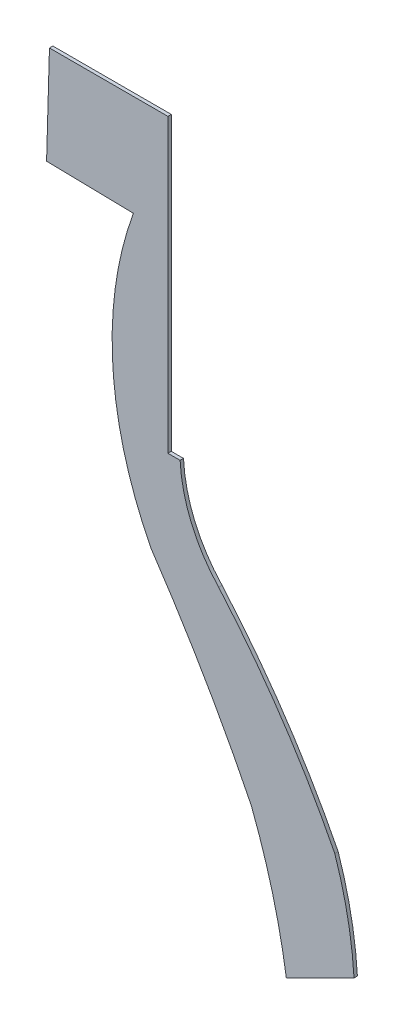
ISO-10303-21;
HEADER;
FILE_DESCRIPTION(('STEP AP214'),'2;1');
FILE_NAME('part.step','',(''),(''),'','','');
FILE_SCHEMA(('AUTOMOTIVE_DESIGN { 1 0 10303 214 1 1 1 1 }'));
ENDSEC;
DATA;
#1=APPLICATION_CONTEXT('core data for automotive mechanical design processes');
#2=APPLICATION_PROTOCOL_DEFINITION('international standard','automotive_design',2000,#1);
#3=PRODUCT_CONTEXT('',#1,'mechanical');
#4=PRODUCT('Part','Part','',(#3));
#5=PRODUCT_RELATED_PRODUCT_CATEGORY('part','',(#4));
#6=PRODUCT_DEFINITION_FORMATION('','',#4);
#7=PRODUCT_DEFINITION_CONTEXT('part definition',#1,'design');
#8=PRODUCT_DEFINITION('design','',#6,#7);
#9=PRODUCT_DEFINITION_SHAPE('','',#8);
#10=(LENGTH_UNIT() NAMED_UNIT(*) SI_UNIT(.MILLI.,.METRE.));
#11=(NAMED_UNIT(*) PLANE_ANGLE_UNIT() SI_UNIT($,.RADIAN.));
#12=(NAMED_UNIT(*) SI_UNIT($,.STERADIAN.) SOLID_ANGLE_UNIT());
#13=UNCERTAINTY_MEASURE_WITH_UNIT(LENGTH_MEASURE(1.E-05),#10,'distance_accuracy_value','');
#14=(GEOMETRIC_REPRESENTATION_CONTEXT(3) GLOBAL_UNCERTAINTY_ASSIGNED_CONTEXT((#13)) GLOBAL_UNIT_ASSIGNED_CONTEXT((#10,
#11,#12)) REPRESENTATION_CONTEXT('',''));
#15=CARTESIAN_POINT('',(0.,0.,0.));
#16=DIRECTION('',(0.,0.,1.));
#17=DIRECTION('',(1.,0.,0.));
#18=AXIS2_PLACEMENT_3D('',#15,#16,#17);
#19=CARTESIAN_POINT('',(20.883239029855,8.34188143501199,0.1));
#20=DIRECTION('',(0.,0.,-1.));
#21=DIRECTION('',(-1.,0.,0.));
#22=AXIS2_PLACEMENT_3D('',#19,#20,#21);
#23=CYLINDRICAL_SURFACE('',#22,4.2453518742841);
#24=CARTESIAN_POINT('',(20.883239029855,8.34188143501199,0.));
#25=DIRECTION('',(0.,0.,-1.));
#26=DIRECTION('',(1.,0.,0.));
#27=AXIS2_PLACEMENT_3D('',#24,#25,#26);
#28=CIRCLE('',#27,4.2453518742841);
#29=CARTESIAN_POINT('',(17.7828452557715,5.44178299149117,0.));
#30=VERTEX_POINT('',#29);
#31=CARTESIAN_POINT('',(16.6436989690737,8.11981700850885,0.));
#32=VERTEX_POINT('',#31);
#33=EDGE_CURVE('E153',#30,#32,#28,.T.);
#34=ORIENTED_EDGE('',*,*,#33,.T.);
#35=DIRECTION('',(0.,0.,-1.));
#36=VECTOR('',#35,1.);
#37=CARTESIAN_POINT('',(16.6436989690737,8.11981700850885,0.1));
#38=LINE('',#37,#36);
#39=CARTESIAN_POINT('',(16.6436989690737,8.11981700850885,0.1));
#40=VERTEX_POINT('',#39);
#41=EDGE_CURVE('E11',#40,#32,#38,.T.);
#42=ORIENTED_EDGE('',*,*,#41,.F.);
#43=CARTESIAN_POINT('',(20.883239029855,8.34188143501199,0.1));
#44=DIRECTION('',(0.,0.,-1.));
#45=DIRECTION('',(1.,0.,0.));
#46=AXIS2_PLACEMENT_3D('',#43,#44,#45);
#47=CIRCLE('',#46,4.2453518742841);
#48=CARTESIAN_POINT('',(17.7828452557715,5.44178299149117,0.1));
#49=VERTEX_POINT('',#48);
#50=EDGE_CURVE('E175',#49,#40,#47,.T.);
#51=ORIENTED_EDGE('',*,*,#50,.F.);
#52=DIRECTION('',(0.,0.,-1.));
#53=VECTOR('',#52,1.);
#54=CARTESIAN_POINT('',(17.7828452557715,5.44178299149117,0.1));
#55=LINE('',#54,#53);
#56=EDGE_CURVE('E149',#49,#30,#55,.T.);
#57=ORIENTED_EDGE('',*,*,#56,.T.);
#58=EDGE_LOOP('',(#34,#42,#51,#57));
#59=FACE_BOUND('',#58,.T.);
#60=ADVANCED_FACE('F33',(#59),#23,.F.);
#61=CARTESIAN_POINT('',(16.6436989690737,8.11981700850885,0.1));
#62=DIRECTION('',(0.,-1.,0.));
#63=DIRECTION('',(0.,0.,-1.));
#64=AXIS2_PLACEMENT_3D('',#61,#62,#63);
#65=PLANE('',#64);
#66=DIRECTION('',(-1.,0.,0.));
#67=VECTOR('',#66,1.);
#68=CARTESIAN_POINT('',(16.6436989690737,8.11981700850885,0.));
#69=LINE('',#68,#67);
#70=CARTESIAN_POINT('',(16.2841027125994,8.11981700850885,0.));
#71=VERTEX_POINT('',#70);
#72=EDGE_CURVE('E156',#32,#71,#69,.T.);
#73=ORIENTED_EDGE('',*,*,#72,.T.);
#74=DIRECTION('',(0.,0.,-1.));
#75=VECTOR('',#74,1.);
#76=CARTESIAN_POINT('',(16.2841027125994,8.11981700850885,0.1));
#77=LINE('',#76,#75);
#78=CARTESIAN_POINT('',(16.2841027125994,8.11981700850885,0.1));
#79=VERTEX_POINT('',#78);
#80=EDGE_CURVE('E41',#79,#71,#77,.T.);
#81=ORIENTED_EDGE('',*,*,#80,.F.);
#82=DIRECTION('',(-1.,0.,0.));
#83=VECTOR('',#82,1.);
#84=CARTESIAN_POINT('',(16.6436989690737,8.11981700850885,0.1));
#85=LINE('',#84,#83);
#86=EDGE_CURVE('E104',#40,#79,#85,.T.);
#87=ORIENTED_EDGE('',*,*,#86,.F.);
#88=ORIENTED_EDGE('',*,*,#41,.T.);
#89=EDGE_LOOP('',(#73,#81,#87,#88));
#90=FACE_BOUND('',#89,.T.);
#91=ADVANCED_FACE('F253',(#90),#65,.F.);
#92=CARTESIAN_POINT('',(16.2841027125994,8.11981700850885,0.1));
#93=DIRECTION('',(-1.,0.,0.));
#94=DIRECTION('',(0.,-1.,0.));
#95=AXIS2_PLACEMENT_3D('',#92,#93,#94);
#96=PLANE('',#95);
#97=DIRECTION('',(0.,1.,0.));
#98=VECTOR('',#97,1.);
#99=CARTESIAN_POINT('',(16.2841027125994,8.11981700850885,0.));
#100=LINE('',#99,#98);
#101=CARTESIAN_POINT('',(16.2841027125994,16.7417829914911,0.));
#102=VERTEX_POINT('',#101);
#103=EDGE_CURVE('E158',#71,#102,#100,.T.);
#104=ORIENTED_EDGE('',*,*,#103,.T.);
#105=DIRECTION('',(0.,0.,-1.));
#106=VECTOR('',#105,1.);
#107=CARTESIAN_POINT('',(16.2841027125994,16.7417829914911,0.1));
#108=LINE('',#107,#106);
#109=CARTESIAN_POINT('',(16.2841027125994,16.7417829914911,0.1));
#110=VERTEX_POINT('',#109);
#111=EDGE_CURVE('E194',#110,#102,#108,.T.);
#112=ORIENTED_EDGE('',*,*,#111,.F.);
#113=DIRECTION('',(0.,1.,0.));
#114=VECTOR('',#113,1.);
#115=CARTESIAN_POINT('',(16.2841027125994,8.11981700850885,0.1));
#116=LINE('',#115,#114);
#117=EDGE_CURVE('E202',#79,#110,#116,.T.);
#118=ORIENTED_EDGE('',*,*,#117,.F.);
#119=ORIENTED_EDGE('',*,*,#80,.T.);
#120=EDGE_LOOP('',(#104,#112,#118,#119));
#121=FACE_BOUND('',#120,.T.);
#122=ADVANCED_FACE('F200',(#121),#96,.F.);
#123=CARTESIAN_POINT('',(12.7828452557715,16.7417829914911,0.1));
#124=DIRECTION('',(0.,-1.,0.));
#125=DIRECTION('',(0.,0.,-1.));
#126=AXIS2_PLACEMENT_3D('',#123,#124,#125);
#127=PLANE('',#126);
#128=DIRECTION('',(-1.,0.,0.));
#129=VECTOR('',#128,1.);
#130=CARTESIAN_POINT('',(12.7828452557715,16.7417829914911,0.));
#131=LINE('',#130,#129);
#132=CARTESIAN_POINT('',(12.7828452557715,16.7417829914911,0.));
#133=VERTEX_POINT('',#132);
#134=EDGE_CURVE('E160',#102,#133,#131,.T.);
#135=ORIENTED_EDGE('',*,*,#134,.T.);
#136=DIRECTION('',(0.,0.,-1.));
#137=VECTOR('',#136,1.);
#138=CARTESIAN_POINT('',(12.7828452557715,16.7417829914911,0.1));
#139=LINE('',#138,#137);
#140=CARTESIAN_POINT('',(12.7828452557715,16.7417829914911,0.1));
#141=VERTEX_POINT('',#140);
#142=EDGE_CURVE('E191',#141,#133,#139,.T.);
#143=ORIENTED_EDGE('',*,*,#142,.F.);
#144=DIRECTION('',(-1.,0.,0.));
#145=VECTOR('',#144,1.);
#146=CARTESIAN_POINT('',(12.7828452557715,16.7417829914911,0.1));
#147=LINE('',#146,#145);
#148=EDGE_CURVE('E220',#110,#141,#147,.T.);
#149=ORIENTED_EDGE('',*,*,#148,.F.);
#150=ORIENTED_EDGE('',*,*,#111,.T.);
#151=EDGE_LOOP('',(#135,#143,#149,#150));
#152=FACE_BOUND('',#151,.T.);
#153=ADVANCED_FACE('F211',(#152),#127,.F.);
#154=CARTESIAN_POINT('',(12.7828452557715,16.7417829914911,0.1));
#155=DIRECTION('',(0.999586515556858,-0.0287540939154667,0.));
#156=DIRECTION('',(0.0287540939154667,0.999586515556858,0.));
#157=AXIS2_PLACEMENT_3D('',#154,#155,#156);
#158=PLANE('',#157);
#159=DIRECTION('',(-0.0287540939154667,-0.999586515556858,0.));
#160=VECTOR('',#159,1.);
#161=CARTESIAN_POINT('',(12.7828452557715,16.7417829914911,0.));
#162=LINE('',#161,#160);
#163=CARTESIAN_POINT('',(12.6982972874006,13.8026185945963,0.));
#164=VERTEX_POINT('',#163);
#165=EDGE_CURVE('E162',#133,#164,#162,.T.);
#166=ORIENTED_EDGE('',*,*,#165,.T.);
#167=DIRECTION('',(0.,0.,-1.));
#168=VECTOR('',#167,1.);
#169=CARTESIAN_POINT('',(12.6982972874006,13.8026185945963,0.1));
#170=LINE('',#169,#168);
#171=CARTESIAN_POINT('',(12.6982972874006,13.8026185945963,0.1));
#172=VERTEX_POINT('',#171);
#173=EDGE_CURVE('E188',#172,#164,#170,.T.);
#174=ORIENTED_EDGE('',*,*,#173,.F.);
#175=DIRECTION('',(-0.0287540939154667,-0.999586515556858,0.));
#176=VECTOR('',#175,1.);
#177=CARTESIAN_POINT('',(12.7828452557715,16.7417829914911,0.1));
#178=LINE('',#177,#176);
#179=EDGE_CURVE('E217',#141,#172,#178,.T.);
#180=ORIENTED_EDGE('',*,*,#179,.F.);
#181=ORIENTED_EDGE('',*,*,#142,.T.);
#182=EDGE_LOOP('',(#166,#174,#180,#181));
#183=FACE_BOUND('',#182,.T.);
#184=ADVANCED_FACE('F215',(#183),#158,.F.);
#185=CARTESIAN_POINT('',(12.6982972874006,13.8026185945963,0.1));
#186=DIRECTION('',(0.0201481859062928,0.999797004698797,0.));
#187=DIRECTION('',(-0.999797004698797,0.0201481859062928,0.));
#188=AXIS2_PLACEMENT_3D('',#185,#186,#187);
#189=PLANE('',#188);
#190=DIRECTION('',(0.999797004698797,-0.0201481859062928,0.));
#191=VECTOR('',#190,1.);
#192=CARTESIAN_POINT('',(12.6982972874006,13.8026185945963,0.));
#193=LINE('',#192,#191);
#194=CARTESIAN_POINT('',(15.2636163865531,13.7509215742254,0.));
#195=VERTEX_POINT('',#194);
#196=EDGE_CURVE('E164',#164,#195,#193,.T.);
#197=ORIENTED_EDGE('',*,*,#196,.T.);
#198=DIRECTION('',(0.,0.,-1.));
#199=VECTOR('',#198,1.);
#200=CARTESIAN_POINT('',(15.2636163865531,13.7509215742254,0.1));
#201=LINE('',#200,#199);
#202=CARTESIAN_POINT('',(15.2636163865531,13.7509215742254,0.1));
#203=VERTEX_POINT('',#202);
#204=EDGE_CURVE('E185',#203,#195,#201,.T.);
#205=ORIENTED_EDGE('',*,*,#204,.F.);
#206=DIRECTION('',(0.999797004698797,-0.0201481859062928,0.));
#207=VECTOR('',#206,1.);
#208=CARTESIAN_POINT('',(12.6982972874006,13.8026185945963,0.1));
#209=LINE('',#208,#207);
#210=EDGE_CURVE('E219',#172,#203,#209,.T.);
#211=ORIENTED_EDGE('',*,*,#210,.F.);
#212=ORIENTED_EDGE('',*,*,#173,.T.);
#213=EDGE_LOOP('',(#197,#205,#211,#212));
#214=FACE_BOUND('',#213,.T.);
#215=ADVANCED_FACE('F266',(#214),#189,.F.);
#216=CARTESIAN_POINT('',(25.0284684528718,10.1903240571912,0.1));
#217=DIRECTION('',(0.,0.,-1.));
#218=DIRECTION('',(-1.,0.,0.));
#219=AXIS2_PLACEMENT_3D('',#216,#217,#218);
#220=CYLINDRICAL_SURFACE('',#219,10.3937572876895);
#221=CARTESIAN_POINT('',(25.0284684528718,10.1903240571912,0.));
#222=DIRECTION('',(0.,0.,1.));
#223=DIRECTION('',(1.,0.,0.));
#224=AXIS2_PLACEMENT_3D('',#221,#222,#223);
#225=CIRCLE('',#224,10.3937572876895);
#226=CARTESIAN_POINT('',(15.7828452557715,5.44178299149117,0.));
#227=VERTEX_POINT('',#226);
#228=EDGE_CURVE('E166',#195,#227,#225,.T.);
#229=ORIENTED_EDGE('',*,*,#228,.T.);
#230=DIRECTION('',(0.,0.,-1.));
#231=VECTOR('',#230,1.);
#232=CARTESIAN_POINT('',(15.7828452557715,5.44178299149117,0.1));
#233=LINE('',#232,#231);
#234=CARTESIAN_POINT('',(15.7828452557715,5.44178299149117,0.1));
#235=VERTEX_POINT('',#234);
#236=EDGE_CURVE('E182',#235,#227,#233,.T.);
#237=ORIENTED_EDGE('',*,*,#236,.F.);
#238=CARTESIAN_POINT('',(25.0284684528718,10.1903240571912,0.1));
#239=DIRECTION('',(0.,0.,1.));
#240=DIRECTION('',(1.,0.,0.));
#241=AXIS2_PLACEMENT_3D('',#238,#239,#240);
#242=CIRCLE('',#241,10.3937572876895);
#243=EDGE_CURVE('E222',#203,#235,#242,.T.);
#244=ORIENTED_EDGE('',*,*,#243,.F.);
#245=ORIENTED_EDGE('',*,*,#204,.T.);
#246=EDGE_LOOP('',(#229,#237,#244,#245));
#247=FACE_BOUND('',#246,.T.);
#248=ADVANCED_FACE('F269',(#247),#220,.T.);
#249=CARTESIAN_POINT('',(-19.7541401659329,-18.6116931121863,0.1));
#250=DIRECTION('',(0.,0.,-1.));
#251=DIRECTION('',(-1.,0.,0.));
#252=AXIS2_PLACEMENT_3D('',#249,#250,#251);
#253=CYLINDRICAL_SURFACE('',#252,42.912085075566);
#254=CARTESIAN_POINT('',(-19.7541401659329,-18.6116931121863,0.));
#255=DIRECTION('',(0.,0.,-1.));
#256=DIRECTION('',(1.,0.,0.));
#257=AXIS2_PLACEMENT_3D('',#254,#255,#256);
#258=CIRCLE('',#257,42.912085075566);
#259=CARTESIAN_POINT('',(18.7453765728516,0.341782991491166,0.));
#260=VERTEX_POINT('',#259);
#261=EDGE_CURVE('E168',#227,#260,#258,.T.);
#262=ORIENTED_EDGE('',*,*,#261,.T.);
#263=DIRECTION('',(0.,0.,-1.));
#264=VECTOR('',#263,1.);
#265=CARTESIAN_POINT('',(18.7453765728516,0.341782991491166,0.1));
#266=LINE('',#265,#264);
#267=CARTESIAN_POINT('',(18.7453765728516,0.341782991491166,0.1));
#268=VERTEX_POINT('',#267);
#269=EDGE_CURVE('E179',#268,#260,#266,.T.);
#270=ORIENTED_EDGE('',*,*,#269,.F.);
#271=CARTESIAN_POINT('',(-19.7541401659329,-18.6116931121863,0.1));
#272=DIRECTION('',(0.,0.,-1.));
#273=DIRECTION('',(1.,0.,0.));
#274=AXIS2_PLACEMENT_3D('',#271,#272,#273);
#275=CIRCLE('',#274,42.912085075566);
#276=EDGE_CURVE('E228',#235,#268,#275,.T.);
#277=ORIENTED_EDGE('',*,*,#276,.F.);
#278=ORIENTED_EDGE('',*,*,#236,.T.);
#279=EDGE_LOOP('',(#262,#270,#277,#278));
#280=FACE_BOUND('',#279,.T.);
#281=ADVANCED_FACE('F234',(#280),#253,.F.);
#282=CARTESIAN_POINT('',(1.75133498060392,-6.26692382446182,0.1));
#283=DIRECTION('',(0.,0.,-1.));
#284=DIRECTION('',(-1.,0.,0.));
#285=AXIS2_PLACEMENT_3D('',#282,#283,#284);
#286=CYLINDRICAL_SURFACE('',#285,18.2338272290341);
#287=CARTESIAN_POINT('',(1.75133498060392,-6.26692382446182,0.));
#288=DIRECTION('',(0.,0.,-1.));
#289=DIRECTION('',(1.,0.,0.));
#290=AXIS2_PLACEMENT_3D('',#287,#288,#289);
#291=CIRCLE('',#290,18.2338272290341);
#292=CARTESIAN_POINT('',(19.7828452557716,-3.55821700850883,0.));
#293=VERTEX_POINT('',#292);
#294=EDGE_CURVE('E170',#260,#293,#291,.T.);
#295=ORIENTED_EDGE('',*,*,#294,.T.);
#296=DIRECTION('',(0.,0.,-1.));
#297=VECTOR('',#296,1.);
#298=CARTESIAN_POINT('',(19.7828452557716,-3.55821700850883,0.1));
#299=LINE('',#298,#297);
#300=CARTESIAN_POINT('',(19.7828452557716,-3.55821700850883,0.1));
#301=VERTEX_POINT('',#300);
#302=EDGE_CURVE('E144',#301,#293,#299,.T.);
#303=ORIENTED_EDGE('',*,*,#302,.F.);
#304=CARTESIAN_POINT('',(1.75133498060392,-6.26692382446182,0.1));
#305=DIRECTION('',(0.,0.,-1.));
#306=DIRECTION('',(1.,0.,0.));
#307=AXIS2_PLACEMENT_3D('',#304,#305,#306);
#308=CIRCLE('',#307,18.2338272290341);
#309=EDGE_CURVE('E135',#268,#301,#308,.T.);
#310=ORIENTED_EDGE('',*,*,#309,.F.);
#311=ORIENTED_EDGE('',*,*,#269,.T.);
#312=EDGE_LOOP('',(#295,#303,#310,#311));
#313=FACE_BOUND('',#312,.T.);
#314=ADVANCED_FACE('F238',(#313),#286,.F.);
#315=CARTESIAN_POINT('',(19.7828452557716,-3.55821700850883,0.1));
#316=DIRECTION('',(-0.447213595499962,0.894427190999914,0.));
#317=DIRECTION('',(-0.894427190999914,-0.447213595499962,0.));
#318=AXIS2_PLACEMENT_3D('',#315,#316,#317);
#319=PLANE('',#318);
#320=DIRECTION('',(0.894427190999914,0.447213595499962,0.));
#321=VECTOR('',#320,1.);
#322=CARTESIAN_POINT('',(19.7828452557716,-3.55821700850883,0.));
#323=LINE('',#322,#321);
#324=CARTESIAN_POINT('',(21.7828452557715,-2.55821700850882,0.));
#325=VERTEX_POINT('',#324);
#326=EDGE_CURVE('E143',#293,#325,#323,.T.);
#327=ORIENTED_EDGE('',*,*,#326,.T.);
#328=DIRECTION('',(0.,0.,-1.));
#329=VECTOR('',#328,1.);
#330=CARTESIAN_POINT('',(21.7828452557715,-2.55821700850882,0.1));
#331=LINE('',#330,#329);
#332=CARTESIAN_POINT('',(21.7828452557715,-2.55821700850882,0.1));
#333=VERTEX_POINT('',#332);
#334=EDGE_CURVE('E140',#333,#325,#331,.T.);
#335=ORIENTED_EDGE('',*,*,#334,.F.);
#336=DIRECTION('',(0.894427190999914,0.447213595499962,0.));
#337=VECTOR('',#336,1.);
#338=CARTESIAN_POINT('',(19.7828452557716,-3.55821700850883,0.1));
#339=LINE('',#338,#337);
#340=EDGE_CURVE('E129',#301,#333,#339,.T.);
#341=ORIENTED_EDGE('',*,*,#340,.F.);
#342=ORIENTED_EDGE('',*,*,#302,.T.);
#343=EDGE_LOOP('',(#327,#335,#341,#342));
#344=FACE_BOUND('',#343,.T.);
#345=ADVANCED_FACE('F141',(#344),#319,.F.);
#346=CARTESIAN_POINT('',(10.673083110134,-3.23166958671465,0.1));
#347=DIRECTION('',(0.,0.,-1.));
#348=DIRECTION('',(-1.,0.,0.));
#349=AXIS2_PLACEMENT_3D('',#346,#347,#348);
#350=CYLINDRICAL_SURFACE('',#349,11.1301551340371);
#351=CARTESIAN_POINT('',(10.673083110134,-3.23166958671465,0.));
#352=DIRECTION('',(0.,0.,1.));
#353=DIRECTION('',(1.,0.,0.));
#354=AXIS2_PLACEMENT_3D('',#351,#352,#353);
#355=CIRCLE('',#354,11.1301551340371);
#356=CARTESIAN_POINT('',(21.2139934113863,0.341782991491164,0.));
#357=VERTEX_POINT('',#356);
#358=EDGE_CURVE('E90',#325,#357,#355,.T.);
#359=ORIENTED_EDGE('',*,*,#358,.T.);
#360=DIRECTION('',(0.,0.,-1.));
#361=VECTOR('',#360,1.);
#362=CARTESIAN_POINT('',(21.2139934113863,0.341782991491164,0.1));
#363=LINE('',#362,#361);
#364=CARTESIAN_POINT('',(21.2139934113863,0.341782991491164,0.1));
#365=VERTEX_POINT('',#364);
#366=EDGE_CURVE('E145',#365,#357,#363,.T.);
#367=ORIENTED_EDGE('',*,*,#366,.F.);
#368=CARTESIAN_POINT('',(10.673083110134,-3.23166958671465,0.1));
#369=DIRECTION('',(0.,0.,1.));
#370=DIRECTION('',(1.,0.,0.));
#371=AXIS2_PLACEMENT_3D('',#368,#369,#370);
#372=CIRCLE('',#371,11.1301551340371);
#373=EDGE_CURVE('E133',#333,#365,#372,.T.);
#374=ORIENTED_EDGE('',*,*,#373,.F.);
#375=ORIENTED_EDGE('',*,*,#334,.T.);
#376=EDGE_LOOP('',(#359,#367,#374,#375));
#377=FACE_BOUND('',#376,.T.);
#378=ADVANCED_FACE('F147',(#377),#350,.T.);
#379=CARTESIAN_POINT('',(-1.03785520625993,-10.924491618424,0.1));
#380=DIRECTION('',(0.,0.,-1.));
#381=DIRECTION('',(-1.,0.,0.));
#382=AXIS2_PLACEMENT_3D('',#379,#380,#381);
#383=CYLINDRICAL_SURFACE('',#382,24.9414055435668);
#384=CARTESIAN_POINT('',(-1.03785520625993,-10.924491618424,0.));
#385=DIRECTION('',(0.,0.,1.));
#386=DIRECTION('',(1.,0.,0.));
#387=AXIS2_PLACEMENT_3D('',#384,#385,#386);
#388=CIRCLE('',#387,24.9414055435668);
#389=EDGE_CURVE('E96',#357,#30,#388,.T.);
#390=ORIENTED_EDGE('',*,*,#389,.T.);
#391=ORIENTED_EDGE('',*,*,#56,.F.);
#392=CARTESIAN_POINT('',(-1.03785520625993,-10.924491618424,0.1));
#393=DIRECTION('',(0.,0.,1.));
#394=DIRECTION('',(1.,0.,0.));
#395=AXIS2_PLACEMENT_3D('',#392,#393,#394);
#396=CIRCLE('',#395,24.9414055435668);
#397=EDGE_CURVE('E49',#365,#49,#396,.T.);
#398=ORIENTED_EDGE('',*,*,#397,.F.);
#399=ORIENTED_EDGE('',*,*,#366,.T.);
#400=EDGE_LOOP('',(#390,#391,#398,#399));
#401=FACE_BOUND('',#400,.T.);
#402=ADVANCED_FACE('F242',(#401),#383,.T.);
#403=CARTESIAN_POINT('',(20.883239029855,8.34188143501199,0.1));
#404=DIRECTION('',(0.,0.,1.));
#405=DIRECTION('',(1.,0.,0.));
#406=AXIS2_PLACEMENT_3D('',#403,#404,#405);
#407=PLANE('',#406);
#408=ORIENTED_EDGE('',*,*,#50,.T.);
#409=ORIENTED_EDGE('',*,*,#86,.T.);
#410=ORIENTED_EDGE('',*,*,#117,.T.);
#411=ORIENTED_EDGE('',*,*,#148,.T.);
#412=ORIENTED_EDGE('',*,*,#179,.T.);
#413=ORIENTED_EDGE('',*,*,#210,.T.);
#414=ORIENTED_EDGE('',*,*,#243,.T.);
#415=ORIENTED_EDGE('',*,*,#276,.T.);
#416=ORIENTED_EDGE('',*,*,#309,.T.);
#417=ORIENTED_EDGE('',*,*,#340,.T.);
#418=ORIENTED_EDGE('',*,*,#373,.T.);
#419=ORIENTED_EDGE('',*,*,#397,.T.);
#420=EDGE_LOOP('',(#408,#409,#410,#411,#412,#413,#414,#415,#416,#417,#418,#419));
#421=FACE_BOUND('',#420,.T.);
#422=ADVANCED_FACE('F131',(#421),#407,.T.);
#423=CARTESIAN_POINT('',(20.883239029855,8.34188143501199,0.));
#424=DIRECTION('',(0.,0.,1.));
#425=DIRECTION('',(1.,0.,0.));
#426=AXIS2_PLACEMENT_3D('',#423,#424,#425);
#427=PLANE('',#426);
#428=ORIENTED_EDGE('',*,*,#33,.F.);
#429=ORIENTED_EDGE('',*,*,#389,.F.);
#430=ORIENTED_EDGE('',*,*,#358,.F.);
#431=ORIENTED_EDGE('',*,*,#326,.F.);
#432=ORIENTED_EDGE('',*,*,#294,.F.);
#433=ORIENTED_EDGE('',*,*,#261,.F.);
#434=ORIENTED_EDGE('',*,*,#228,.F.);
#435=ORIENTED_EDGE('',*,*,#196,.F.);
#436=ORIENTED_EDGE('',*,*,#165,.F.);
#437=ORIENTED_EDGE('',*,*,#134,.F.);
#438=ORIENTED_EDGE('',*,*,#103,.F.);
#439=ORIENTED_EDGE('',*,*,#72,.F.);
#440=EDGE_LOOP('',(#428,#429,#430,#431,#432,#433,#434,#435,#436,#437,#438,#439));
#441=FACE_BOUND('',#440,.T.);
#442=ADVANCED_FACE('F206',(#441),#427,.F.);
#443=CLOSED_SHELL('',(#60,#91,#122,#153,#184,#215,#248,#281,#314,#345,#378,#402,#422,#442));
#444=MANIFOLD_SOLID_BREP('B2',#443);
#445=ADVANCED_BREP_SHAPE_REPRESENTATION('',(#18,#444),#14);
#446=SHAPE_DEFINITION_REPRESENTATION(#9,#445);
ENDSEC;
END-ISO-10303-21;
